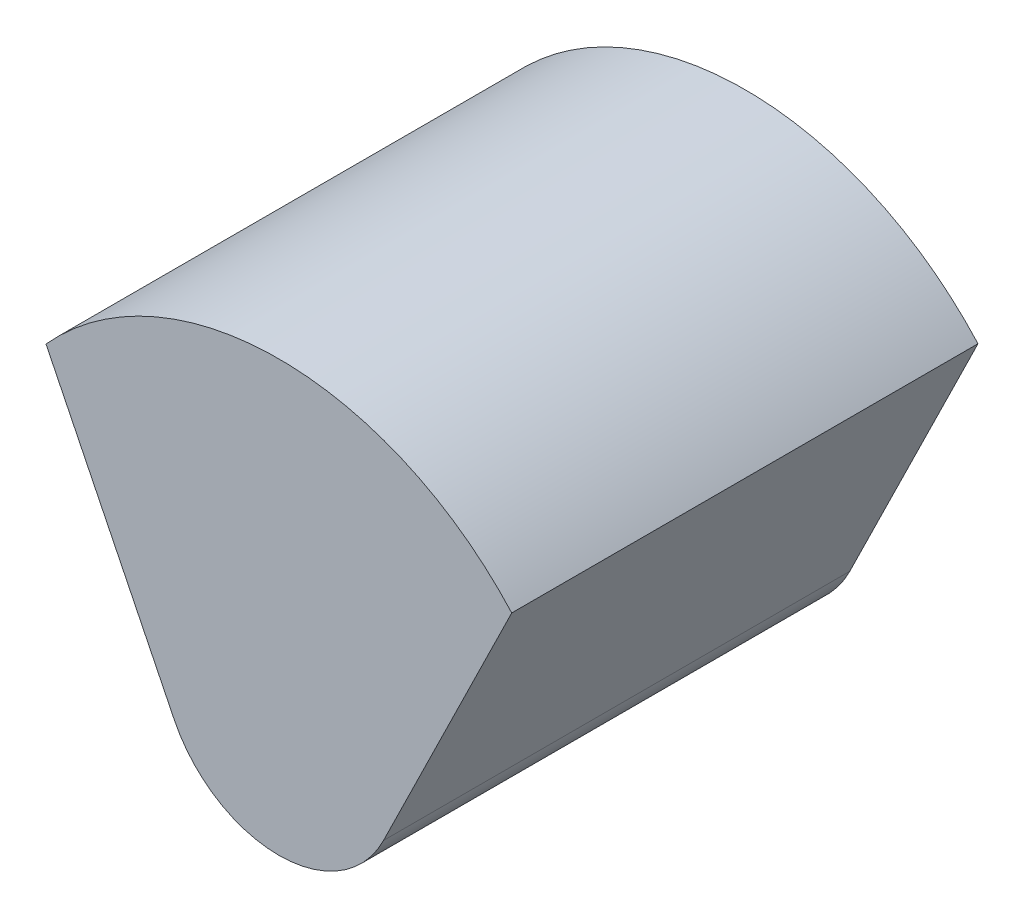
ISO-10303-21;
HEADER;
FILE_DESCRIPTION(('STEP AP214'),'2;1');
FILE_NAME('part.step','',(''),(''),'','','');
FILE_SCHEMA(('AUTOMOTIVE_DESIGN { 1 0 10303 214 1 1 1 1 }'));
ENDSEC;
DATA;
#1=APPLICATION_CONTEXT('core data for automotive mechanical design processes');
#2=APPLICATION_PROTOCOL_DEFINITION('international standard','automotive_design',2000,#1);
#3=PRODUCT_CONTEXT('',#1,'mechanical');
#4=PRODUCT('Part','Part','',(#3));
#5=PRODUCT_RELATED_PRODUCT_CATEGORY('part','',(#4));
#6=PRODUCT_DEFINITION_FORMATION('','',#4);
#7=PRODUCT_DEFINITION_CONTEXT('part definition',#1,'design');
#8=PRODUCT_DEFINITION('design','',#6,#7);
#9=PRODUCT_DEFINITION_SHAPE('','',#8);
#10=(LENGTH_UNIT() NAMED_UNIT(*) SI_UNIT(.MILLI.,.METRE.));
#11=(NAMED_UNIT(*) PLANE_ANGLE_UNIT() SI_UNIT($,.RADIAN.));
#12=(NAMED_UNIT(*) SI_UNIT($,.STERADIAN.) SOLID_ANGLE_UNIT());
#13=UNCERTAINTY_MEASURE_WITH_UNIT(LENGTH_MEASURE(1.E-05),#10,'distance_accuracy_value','');
#14=(GEOMETRIC_REPRESENTATION_CONTEXT(3) GLOBAL_UNCERTAINTY_ASSIGNED_CONTEXT((#13)) GLOBAL_UNIT_ASSIGNED_CONTEXT((#10,
#11,#12)) REPRESENTATION_CONTEXT('',''));
#15=CARTESIAN_POINT('',(0.,0.,0.));
#16=DIRECTION('',(0.,0.,1.));
#17=DIRECTION('',(1.,0.,0.));
#18=AXIS2_PLACEMENT_3D('',#15,#16,#17);
#19=CARTESIAN_POINT('',(1.72,15.2,2.));
#20=DIRECTION('',(0.,0.,1.));
#21=DIRECTION('',(1.,0.,0.));
#22=AXIS2_PLACEMENT_3D('',#19,#20,#21);
#23=CYLINDRICAL_SURFACE('',#22,2.68908086817882);
#24=CARTESIAN_POINT('',(1.72,15.2,6.));
#25=DIRECTION('',(0.,0.,1.));
#26=DIRECTION('',(1.,0.,0.));
#27=AXIS2_PLACEMENT_3D('',#24,#25,#26);
#28=CIRCLE('',#27,2.68908086817882);
#29=CARTESIAN_POINT('',(3.71778775539479,17.,6.));
#30=VERTEX_POINT('',#29);
#31=CARTESIAN_POINT('',(-0.277787755394793,17.,6.));
#32=VERTEX_POINT('',#31);
#33=EDGE_CURVE('E100',#30,#32,#28,.T.);
#34=ORIENTED_EDGE('',*,*,#33,.F.);
#35=DIRECTION('',(0.,0.,1.));
#36=VECTOR('',#35,1.);
#37=CARTESIAN_POINT('',(3.71778775539479,17.,2.));
#38=LINE('',#37,#36);
#39=CARTESIAN_POINT('',(3.71778775539479,17.,2.));
#40=VERTEX_POINT('',#39);
#41=EDGE_CURVE('E11',#40,#30,#38,.T.);
#42=ORIENTED_EDGE('',*,*,#41,.F.);
#43=CARTESIAN_POINT('',(1.72,15.2,2.));
#44=DIRECTION('',(0.,0.,1.));
#45=DIRECTION('',(1.,0.,0.));
#46=AXIS2_PLACEMENT_3D('',#43,#44,#45);
#47=CIRCLE('',#46,2.68908086817882);
#48=CARTESIAN_POINT('',(-0.277787755394793,17.,2.));
#49=VERTEX_POINT('',#48);
#50=EDGE_CURVE('E94',#40,#49,#47,.T.);
#51=ORIENTED_EDGE('',*,*,#50,.T.);
#52=DIRECTION('',(0.,0.,1.));
#53=VECTOR('',#52,1.);
#54=CARTESIAN_POINT('',(-0.277787755394793,17.,2.));
#55=LINE('',#54,#53);
#56=EDGE_CURVE('E39',#49,#32,#55,.T.);
#57=ORIENTED_EDGE('',*,*,#56,.T.);
#58=EDGE_LOOP('',(#34,#42,#51,#57));
#59=FACE_BOUND('',#58,.T.);
#60=ADVANCED_FACE('F36',(#59),#23,.T.);
#61=CARTESIAN_POINT('',(2.61764331451469,14.7592773208614,2.));
#62=DIRECTION('',(0.897643314514689,-0.440722679138575,0.));
#63=DIRECTION('',(0.440722679138575,0.897643314514689,0.));
#64=AXIS2_PLACEMENT_3D('',#61,#62,#63);
#65=PLANE('',#64);
#66=DIRECTION('',(0.440722679138575,0.897643314514689,0.));
#67=VECTOR('',#66,1.);
#68=CARTESIAN_POINT('',(2.61764331451469,14.7592773208614,6.));
#69=LINE('',#68,#67);
#70=CARTESIAN_POINT('',(2.61764331451469,14.7592773208614,6.));
#71=VERTEX_POINT('',#70);
#72=EDGE_CURVE('E96',#71,#30,#69,.T.);
#73=ORIENTED_EDGE('',*,*,#72,.F.);
#74=DIRECTION('',(0.,0.,1.));
#75=VECTOR('',#74,1.);
#76=CARTESIAN_POINT('',(2.61764331451469,14.7592773208614,2.));
#77=LINE('',#76,#75);
#78=CARTESIAN_POINT('',(2.61764331451469,14.7592773208614,2.));
#79=VERTEX_POINT('',#78);
#80=EDGE_CURVE('E45',#79,#71,#77,.T.);
#81=ORIENTED_EDGE('',*,*,#80,.F.);
#82=DIRECTION('',(0.440722679138575,0.897643314514689,0.));
#83=VECTOR('',#82,1.);
#84=CARTESIAN_POINT('',(2.61764331451469,14.7592773208614,2.));
#85=LINE('',#84,#83);
#86=EDGE_CURVE('E91',#79,#40,#85,.T.);
#87=ORIENTED_EDGE('',*,*,#86,.T.);
#88=ORIENTED_EDGE('',*,*,#41,.T.);
#89=EDGE_LOOP('',(#73,#81,#87,#88));
#90=FACE_BOUND('',#89,.T.);
#91=ADVANCED_FACE('F110',(#90),#65,.T.);
#92=CARTESIAN_POINT('',(1.72,15.2,2.));
#93=DIRECTION('',(0.,0.,1.));
#94=DIRECTION('',(1.,0.,0.));
#95=AXIS2_PLACEMENT_3D('',#92,#93,#94);
#96=CYLINDRICAL_SURFACE('',#95,1.);
#97=CARTESIAN_POINT('',(1.72,15.2,6.));
#98=DIRECTION('',(0.,0.,1.));
#99=DIRECTION('',(1.,0.,0.));
#100=AXIS2_PLACEMENT_3D('',#97,#98,#99);
#101=CIRCLE('',#100,1.);
#102=CARTESIAN_POINT('',(0.822356685485311,14.7592773208614,6.));
#103=VERTEX_POINT('',#102);
#104=EDGE_CURVE('E86',#103,#71,#101,.T.);
#105=ORIENTED_EDGE('',*,*,#104,.F.);
#106=DIRECTION('',(0.,0.,1.));
#107=VECTOR('',#106,1.);
#108=CARTESIAN_POINT('',(0.822356685485311,14.7592773208614,2.));
#109=LINE('',#108,#107);
#110=CARTESIAN_POINT('',(0.822356685485311,14.7592773208614,2.));
#111=VERTEX_POINT('',#110);
#112=EDGE_CURVE('E81',#111,#103,#109,.T.);
#113=ORIENTED_EDGE('',*,*,#112,.F.);
#114=CARTESIAN_POINT('',(1.72,15.2,2.));
#115=DIRECTION('',(0.,0.,1.));
#116=DIRECTION('',(1.,0.,0.));
#117=AXIS2_PLACEMENT_3D('',#114,#115,#116);
#118=CIRCLE('',#117,1.);
#119=EDGE_CURVE('E84',#111,#79,#118,.T.);
#120=ORIENTED_EDGE('',*,*,#119,.T.);
#121=ORIENTED_EDGE('',*,*,#80,.T.);
#122=EDGE_LOOP('',(#105,#113,#120,#121));
#123=FACE_BOUND('',#122,.T.);
#124=ADVANCED_FACE('F83',(#123),#96,.T.);
#125=CARTESIAN_POINT('',(0.822356685485311,14.7592773208614,2.));
#126=DIRECTION('',(-0.897643314514688,-0.440722679138577,0.));
#127=DIRECTION('',(0.440722679138577,-0.897643314514688,0.));
#128=AXIS2_PLACEMENT_3D('',#125,#126,#127);
#129=PLANE('',#128);
#130=DIRECTION('',(0.440722679138577,-0.897643314514688,0.));
#131=VECTOR('',#130,1.);
#132=CARTESIAN_POINT('',(0.822356685485311,14.7592773208614,6.));
#133=LINE('',#132,#131);
#134=EDGE_CURVE('E103',#32,#103,#133,.T.);
#135=ORIENTED_EDGE('',*,*,#134,.F.);
#136=ORIENTED_EDGE('',*,*,#56,.F.);
#137=DIRECTION('',(0.440722679138577,-0.897643314514688,0.));
#138=VECTOR('',#137,1.);
#139=CARTESIAN_POINT('',(0.822356685485311,14.7592773208614,2.));
#140=LINE('',#139,#138);
#141=EDGE_CURVE('E90',#49,#111,#140,.T.);
#142=ORIENTED_EDGE('',*,*,#141,.T.);
#143=ORIENTED_EDGE('',*,*,#112,.T.);
#144=EDGE_LOOP('',(#135,#136,#142,#143));
#145=FACE_BOUND('',#144,.T.);
#146=ADVANCED_FACE('F93',(#145),#129,.T.);
#147=CARTESIAN_POINT('',(1.72,15.2,2.));
#148=DIRECTION('',(0.,0.,1.));
#149=DIRECTION('',(1.,0.,0.));
#150=AXIS2_PLACEMENT_3D('',#147,#148,#149);
#151=PLANE('',#150);
#152=ORIENTED_EDGE('',*,*,#50,.F.);
#153=ORIENTED_EDGE('',*,*,#86,.F.);
#154=ORIENTED_EDGE('',*,*,#119,.F.);
#155=ORIENTED_EDGE('',*,*,#141,.F.);
#156=EDGE_LOOP('',(#152,#153,#154,#155));
#157=FACE_BOUND('',#156,.T.);
#158=ADVANCED_FACE('F89',(#157),#151,.F.);
#159=CARTESIAN_POINT('',(1.72,15.2,6.));
#160=DIRECTION('',(0.,0.,1.));
#161=DIRECTION('',(1.,0.,0.));
#162=AXIS2_PLACEMENT_3D('',#159,#160,#161);
#163=PLANE('',#162);
#164=ORIENTED_EDGE('',*,*,#33,.T.);
#165=ORIENTED_EDGE('',*,*,#134,.T.);
#166=ORIENTED_EDGE('',*,*,#104,.T.);
#167=ORIENTED_EDGE('',*,*,#72,.T.);
#168=EDGE_LOOP('',(#164,#165,#166,#167));
#169=FACE_BOUND('',#168,.T.);
#170=ADVANCED_FACE('F109',(#169),#163,.T.);
#171=CLOSED_SHELL('',(#60,#91,#124,#146,#158,#170));
#172=MANIFOLD_SOLID_BREP('B2',#171);
#173=ADVANCED_BREP_SHAPE_REPRESENTATION('',(#18,#172),#14);
#174=SHAPE_DEFINITION_REPRESENTATION(#9,#173);
ENDSEC;
END-ISO-10303-21;
